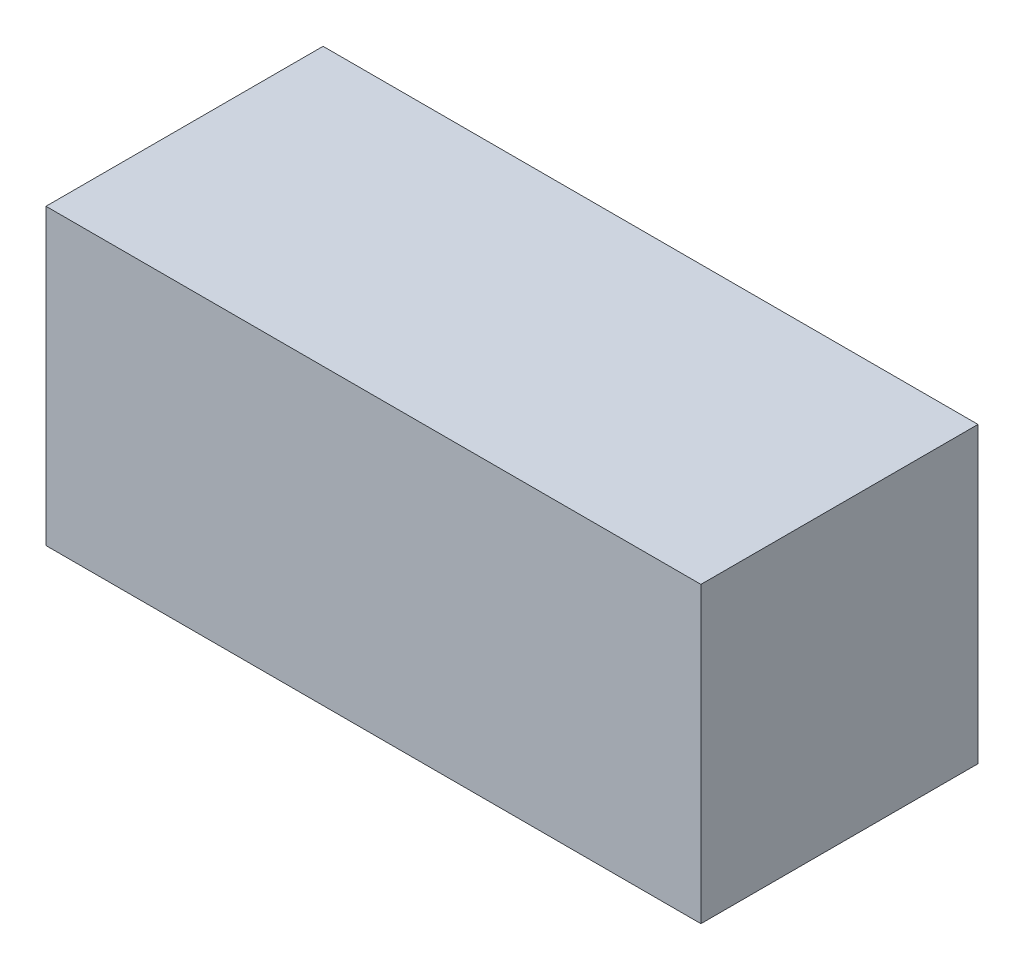
ISO-10303-21;
HEADER;
FILE_DESCRIPTION(('STEP AP214'),'2;1');
FILE_NAME('part.step','',(''),(''),'','','');
FILE_SCHEMA(('AUTOMOTIVE_DESIGN { 1 0 10303 214 1 1 1 1 }'));
ENDSEC;
DATA;
#1=APPLICATION_CONTEXT('core data for automotive mechanical design processes');
#2=APPLICATION_PROTOCOL_DEFINITION('international standard','automotive_design',2000,#1);
#3=PRODUCT_CONTEXT('',#1,'mechanical');
#4=PRODUCT('Part','Part','',(#3));
#5=PRODUCT_RELATED_PRODUCT_CATEGORY('part','',(#4));
#6=PRODUCT_DEFINITION_FORMATION('','',#4);
#7=PRODUCT_DEFINITION_CONTEXT('part definition',#1,'design');
#8=PRODUCT_DEFINITION('design','',#6,#7);
#9=PRODUCT_DEFINITION_SHAPE('','',#8);
#10=(LENGTH_UNIT() NAMED_UNIT(*) SI_UNIT(.MILLI.,.METRE.));
#11=(NAMED_UNIT(*) PLANE_ANGLE_UNIT() SI_UNIT($,.RADIAN.));
#12=(NAMED_UNIT(*) SI_UNIT($,.STERADIAN.) SOLID_ANGLE_UNIT());
#13=UNCERTAINTY_MEASURE_WITH_UNIT(LENGTH_MEASURE(1.E-05),#10,'distance_accuracy_value','');
#14=(GEOMETRIC_REPRESENTATION_CONTEXT(3) GLOBAL_UNCERTAINTY_ASSIGNED_CONTEXT((#13)) GLOBAL_UNIT_ASSIGNED_CONTEXT((#10,
#11,#12)) REPRESENTATION_CONTEXT('',''));
#15=CARTESIAN_POINT('',(0.,0.,0.));
#16=DIRECTION('',(0.,0.,1.));
#17=DIRECTION('',(1.,0.,0.));
#18=AXIS2_PLACEMENT_3D('',#15,#16,#17);
#19=CARTESIAN_POINT('',(0.,0.,33.));
#20=DIRECTION('',(1.,0.,0.));
#21=DIRECTION('',(0.,0.,-1.));
#22=AXIS2_PLACEMENT_3D('',#19,#20,#21);
#23=PLANE('',#22);
#24=DIRECTION('',(0.,-1.,0.));
#25=VECTOR('',#24,1.);
#26=CARTESIAN_POINT('',(0.,0.,0.));
#27=LINE('',#26,#25);
#28=CARTESIAN_POINT('',(0.,35.,0.));
#29=VERTEX_POINT('',#28);
#30=CARTESIAN_POINT('',(0.,0.,0.));
#31=VERTEX_POINT('',#30);
#32=EDGE_CURVE('E96',#29,#31,#27,.T.);
#33=ORIENTED_EDGE('',*,*,#32,.T.);
#34=DIRECTION('',(0.,0.,-1.));
#35=VECTOR('',#34,1.);
#36=CARTESIAN_POINT('',(0.,0.,33.));
#37=LINE('',#36,#35);
#38=CARTESIAN_POINT('',(0.,0.,33.));
#39=VERTEX_POINT('',#38);
#40=EDGE_CURVE('E11',#39,#31,#37,.T.);
#41=ORIENTED_EDGE('',*,*,#40,.F.);
#42=DIRECTION('',(0.,-1.,0.));
#43=VECTOR('',#42,1.);
#44=CARTESIAN_POINT('',(0.,0.,33.));
#45=LINE('',#44,#43);
#46=CARTESIAN_POINT('',(0.,35.,33.));
#47=VERTEX_POINT('',#46);
#48=EDGE_CURVE('E84',#47,#39,#45,.T.);
#49=ORIENTED_EDGE('',*,*,#48,.F.);
#50=DIRECTION('',(0.,0.,-1.));
#51=VECTOR('',#50,1.);
#52=CARTESIAN_POINT('',(0.,35.,33.));
#53=LINE('',#52,#51);
#54=EDGE_CURVE('E92',#47,#29,#53,.T.);
#55=ORIENTED_EDGE('',*,*,#54,.T.);
#56=EDGE_LOOP('',(#33,#41,#49,#55));
#57=FACE_BOUND('',#56,.T.);
#58=ADVANCED_FACE('F33',(#57),#23,.F.);
#59=CARTESIAN_POINT('',(0.,0.,33.));
#60=DIRECTION('',(0.,1.,0.));
#61=DIRECTION('',(0.,0.,1.));
#62=AXIS2_PLACEMENT_3D('',#59,#60,#61);
#63=PLANE('',#62);
#64=DIRECTION('',(1.,0.,0.));
#65=VECTOR('',#64,1.);
#66=CARTESIAN_POINT('',(0.,0.,0.));
#67=LINE('',#66,#65);
#68=CARTESIAN_POINT('',(78.,0.,0.));
#69=VERTEX_POINT('',#68);
#70=EDGE_CURVE('E88',#31,#69,#67,.T.);
#71=ORIENTED_EDGE('',*,*,#70,.T.);
#72=DIRECTION('',(0.,0.,-1.));
#73=VECTOR('',#72,1.);
#74=CARTESIAN_POINT('',(78.,0.,33.));
#75=LINE('',#74,#73);
#76=CARTESIAN_POINT('',(78.,0.,33.));
#77=VERTEX_POINT('',#76);
#78=EDGE_CURVE('E41',#77,#69,#75,.T.);
#79=ORIENTED_EDGE('',*,*,#78,.F.);
#80=DIRECTION('',(1.,0.,0.));
#81=VECTOR('',#80,1.);
#82=CARTESIAN_POINT('',(0.,0.,33.));
#83=LINE('',#82,#81);
#84=EDGE_CURVE('E79',#39,#77,#83,.T.);
#85=ORIENTED_EDGE('',*,*,#84,.F.);
#86=ORIENTED_EDGE('',*,*,#40,.T.);
#87=EDGE_LOOP('',(#71,#79,#85,#86));
#88=FACE_BOUND('',#87,.T.);
#89=ADVANCED_FACE('F87',(#88),#63,.F.);
#90=CARTESIAN_POINT('',(78.,0.,33.));
#91=DIRECTION('',(-1.,0.,0.));
#92=DIRECTION('',(0.,0.,1.));
#93=AXIS2_PLACEMENT_3D('',#90,#91,#92);
#94=PLANE('',#93);
#95=DIRECTION('',(0.,1.,0.));
#96=VECTOR('',#95,1.);
#97=CARTESIAN_POINT('',(78.,0.,0.));
#98=LINE('',#97,#96);
#99=CARTESIAN_POINT('',(78.,35.,0.));
#100=VERTEX_POINT('',#99);
#101=EDGE_CURVE('E66',#69,#100,#98,.T.);
#102=ORIENTED_EDGE('',*,*,#101,.T.);
#103=DIRECTION('',(0.,0.,-1.));
#104=VECTOR('',#103,1.);
#105=CARTESIAN_POINT('',(78.,35.,33.));
#106=LINE('',#105,#104);
#107=CARTESIAN_POINT('',(78.,35.,33.));
#108=VERTEX_POINT('',#107);
#109=EDGE_CURVE('E89',#108,#100,#106,.T.);
#110=ORIENTED_EDGE('',*,*,#109,.F.);
#111=DIRECTION('',(0.,1.,0.));
#112=VECTOR('',#111,1.);
#113=CARTESIAN_POINT('',(78.,0.,33.));
#114=LINE('',#113,#112);
#115=EDGE_CURVE('E82',#77,#108,#114,.T.);
#116=ORIENTED_EDGE('',*,*,#115,.F.);
#117=ORIENTED_EDGE('',*,*,#78,.T.);
#118=EDGE_LOOP('',(#102,#110,#116,#117));
#119=FACE_BOUND('',#118,.T.);
#120=ADVANCED_FACE('F90',(#119),#94,.F.);
#121=CARTESIAN_POINT('',(0.,35.,33.));
#122=DIRECTION('',(0.,-1.,0.));
#123=DIRECTION('',(0.,0.,-1.));
#124=AXIS2_PLACEMENT_3D('',#121,#122,#123);
#125=PLANE('',#124);
#126=DIRECTION('',(-1.,0.,0.));
#127=VECTOR('',#126,1.);
#128=CARTESIAN_POINT('',(0.,35.,0.));
#129=LINE('',#128,#127);
#130=EDGE_CURVE('E72',#100,#29,#129,.T.);
#131=ORIENTED_EDGE('',*,*,#130,.T.);
#132=ORIENTED_EDGE('',*,*,#54,.F.);
#133=DIRECTION('',(-1.,0.,0.));
#134=VECTOR('',#133,1.);
#135=CARTESIAN_POINT('',(0.,35.,33.));
#136=LINE('',#135,#134);
#137=EDGE_CURVE('E49',#108,#47,#136,.T.);
#138=ORIENTED_EDGE('',*,*,#137,.F.);
#139=ORIENTED_EDGE('',*,*,#109,.T.);
#140=EDGE_LOOP('',(#131,#132,#138,#139));
#141=FACE_BOUND('',#140,.T.);
#142=ADVANCED_FACE('F103',(#141),#125,.F.);
#143=CARTESIAN_POINT('',(0.,0.,33.));
#144=DIRECTION('',(0.,0.,-1.));
#145=DIRECTION('',(-1.,0.,0.));
#146=AXIS2_PLACEMENT_3D('',#143,#144,#145);
#147=PLANE('',#146);
#148=ORIENTED_EDGE('',*,*,#48,.T.);
#149=ORIENTED_EDGE('',*,*,#84,.T.);
#150=ORIENTED_EDGE('',*,*,#115,.T.);
#151=ORIENTED_EDGE('',*,*,#137,.T.);
#152=EDGE_LOOP('',(#148,#149,#150,#151));
#153=FACE_BOUND('',#152,.T.);
#154=ADVANCED_FACE('F80',(#153),#147,.F.);
#155=CARTESIAN_POINT('',(0.,0.,0.));
#156=DIRECTION('',(0.,0.,-1.));
#157=DIRECTION('',(-1.,0.,0.));
#158=AXIS2_PLACEMENT_3D('',#155,#156,#157);
#159=PLANE('',#158);
#160=ORIENTED_EDGE('',*,*,#32,.F.);
#161=ORIENTED_EDGE('',*,*,#130,.F.);
#162=ORIENTED_EDGE('',*,*,#101,.F.);
#163=ORIENTED_EDGE('',*,*,#70,.F.);
#164=EDGE_LOOP('',(#160,#161,#162,#163));
#165=FACE_BOUND('',#164,.T.);
#166=ADVANCED_FACE('F106',(#165),#159,.T.);
#167=CLOSED_SHELL('',(#58,#89,#120,#142,#154,#166));
#168=MANIFOLD_SOLID_BREP('B2',#167);
#169=ADVANCED_BREP_SHAPE_REPRESENTATION('',(#18,#168),#14);
#170=SHAPE_DEFINITION_REPRESENTATION(#9,#169);
ENDSEC;
END-ISO-10303-21;
